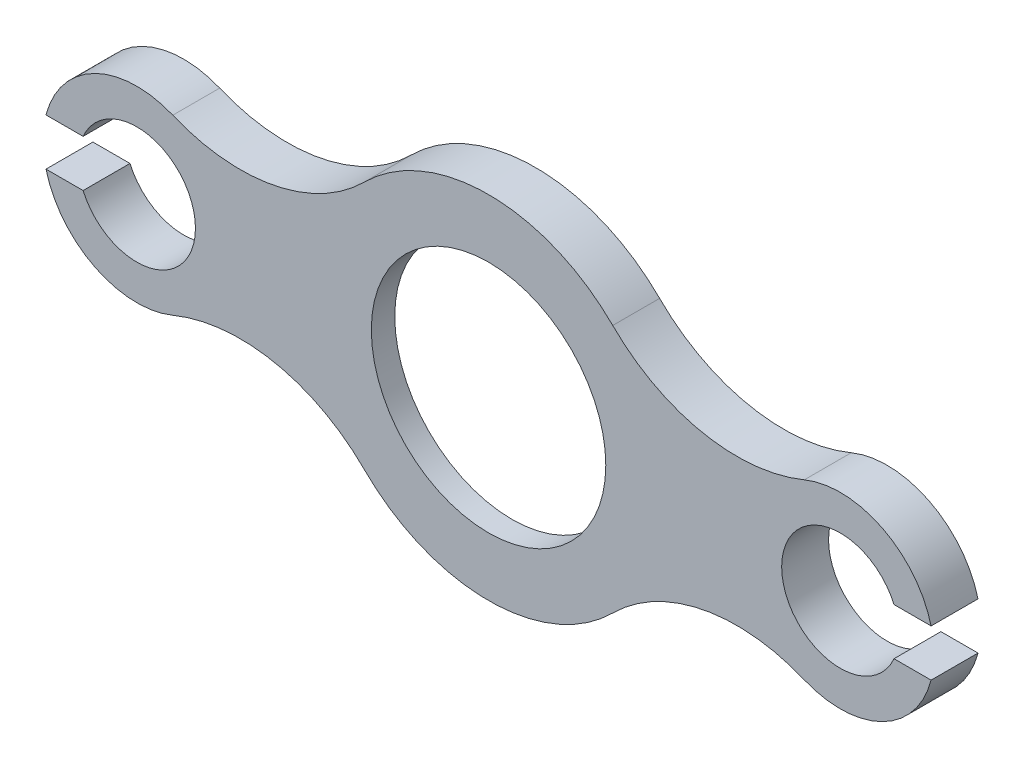
ISO-10303-21;
HEADER;
FILE_DESCRIPTION(('STEP AP214'),'2;1');
FILE_NAME('part.step','',(''),(''),'','','');
FILE_SCHEMA(('AUTOMOTIVE_DESIGN { 1 0 10303 214 1 1 1 1 }'));
ENDSEC;
DATA;
#1=APPLICATION_CONTEXT('core data for automotive mechanical design processes');
#2=APPLICATION_PROTOCOL_DEFINITION('international standard','automotive_design',2000,#1);
#3=PRODUCT_CONTEXT('',#1,'mechanical');
#4=PRODUCT('Part','Part','',(#3));
#5=PRODUCT_RELATED_PRODUCT_CATEGORY('part','',(#4));
#6=PRODUCT_DEFINITION_FORMATION('','',#4);
#7=PRODUCT_DEFINITION_CONTEXT('part definition',#1,'design');
#8=PRODUCT_DEFINITION('design','',#6,#7);
#9=PRODUCT_DEFINITION_SHAPE('','',#8);
#10=(LENGTH_UNIT() NAMED_UNIT(*) SI_UNIT(.MILLI.,.METRE.));
#11=(NAMED_UNIT(*) PLANE_ANGLE_UNIT() SI_UNIT($,.RADIAN.));
#12=(NAMED_UNIT(*) SI_UNIT($,.STERADIAN.) SOLID_ANGLE_UNIT());
#13=UNCERTAINTY_MEASURE_WITH_UNIT(LENGTH_MEASURE(1.E-05),#10,'distance_accuracy_value','');
#14=(GEOMETRIC_REPRESENTATION_CONTEXT(3) GLOBAL_UNCERTAINTY_ASSIGNED_CONTEXT((#13)) GLOBAL_UNIT_ASSIGNED_CONTEXT((#10,
#11,#12)) REPRESENTATION_CONTEXT('',''));
#15=CARTESIAN_POINT('',(0.,0.,0.));
#16=DIRECTION('',(0.,0.,1.));
#17=DIRECTION('',(1.,0.,0.));
#18=AXIS2_PLACEMENT_3D('',#15,#16,#17);
#19=CARTESIAN_POINT('',(150.,0.,20.));
#20=DIRECTION('',(0.,0.,-1.));
#21=DIRECTION('',(-1.,0.,0.));
#22=AXIS2_PLACEMENT_3D('',#19,#20,#21);
#23=CYLINDRICAL_SURFACE('',#22,40.);
#24=CARTESIAN_POINT('',(150.,0.,0.));
#25=DIRECTION('',(0.,0.,1.));
#26=DIRECTION('',(1.,0.,0.));
#27=AXIS2_PLACEMENT_3D('',#24,#25,#26);
#28=CIRCLE('',#27,40.);
#29=CARTESIAN_POINT('',(188.729833462074,-10.,0.));
#30=VERTEX_POINT('',#29);
#31=CARTESIAN_POINT('',(134.666666666667,-36.9444026733264,0.));
#32=VERTEX_POINT('',#31);
#33=EDGE_CURVE('E188',#30,#32,#28,.F.);
#34=ORIENTED_EDGE('',*,*,#33,.F.);
#35=DIRECTION('',(0.,0.,-1.));
#36=VECTOR('',#35,1.);
#37=CARTESIAN_POINT('',(188.729833462074,-10.,20.));
#38=LINE('',#37,#36);
#39=CARTESIAN_POINT('',(188.729833462074,-10.,20.));
#40=VERTEX_POINT('',#39);
#41=EDGE_CURVE('E11',#40,#30,#38,.T.);
#42=ORIENTED_EDGE('',*,*,#41,.F.);
#43=CARTESIAN_POINT('',(150.,0.,20.));
#44=DIRECTION('',(0.,0.,1.));
#45=DIRECTION('',(1.,0.,0.));
#46=AXIS2_PLACEMENT_3D('',#43,#44,#45);
#47=CIRCLE('',#46,40.);
#48=CARTESIAN_POINT('',(134.666666666667,-36.9444026733264,20.));
#49=VERTEX_POINT('',#48);
#50=EDGE_CURVE('E229',#40,#49,#47,.F.);
#51=ORIENTED_EDGE('',*,*,#50,.T.);
#52=DIRECTION('',(0.,0.,-1.));
#53=VECTOR('',#52,1.);
#54=CARTESIAN_POINT('',(134.666666666667,-36.9444026733264,20.));
#55=LINE('',#54,#53);
#56=EDGE_CURVE('E57',#49,#32,#55,.T.);
#57=ORIENTED_EDGE('',*,*,#56,.T.);
#58=EDGE_LOOP('',(#34,#42,#51,#57));
#59=FACE_BOUND('',#58,.T.);
#60=ADVANCED_FACE('F41',(#59),#23,.T.);
#61=CARTESIAN_POINT('',(0.,-9.99999999999998,20.));
#62=DIRECTION('',(0.,-1.,0.));
#63=DIRECTION('',(1.,0.,0.));
#64=AXIS2_PLACEMENT_3D('',#61,#62,#63);
#65=PLANE('',#64);
#66=DIRECTION('',(-1.,0.,0.));
#67=VECTOR('',#66,1.);
#68=CARTESIAN_POINT('',(0.,-9.99999999999998,0.));
#69=LINE('',#68,#67);
#70=CARTESIAN_POINT('',(172.912878474779,-10.,0.));
#71=VERTEX_POINT('',#70);
#72=EDGE_CURVE('E190',#30,#71,#69,.T.);
#73=ORIENTED_EDGE('',*,*,#72,.T.);
#74=DIRECTION('',(0.,0.,-1.));
#75=VECTOR('',#74,1.);
#76=CARTESIAN_POINT('',(172.912878474779,-10.,20.));
#77=LINE('',#76,#75);
#78=CARTESIAN_POINT('',(172.912878474779,-10.,20.));
#79=VERTEX_POINT('',#78);
#80=EDGE_CURVE('E49',#79,#71,#77,.T.);
#81=ORIENTED_EDGE('',*,*,#80,.F.);
#82=DIRECTION('',(-1.,0.,0.));
#83=VECTOR('',#82,1.);
#84=CARTESIAN_POINT('',(0.,-9.99999999999998,20.));
#85=LINE('',#84,#83);
#86=EDGE_CURVE('E280',#40,#79,#85,.T.);
#87=ORIENTED_EDGE('',*,*,#86,.F.);
#88=ORIENTED_EDGE('',*,*,#41,.T.);
#89=EDGE_LOOP('',(#73,#81,#87,#88));
#90=FACE_BOUND('',#89,.T.);
#91=ADVANCED_FACE('F321',(#90),#65,.F.);
#92=CARTESIAN_POINT('',(150.,0.,20.));
#93=DIRECTION('',(0.,0.,-1.));
#94=DIRECTION('',(-1.,0.,0.));
#95=AXIS2_PLACEMENT_3D('',#92,#93,#94);
#96=CYLINDRICAL_SURFACE('',#95,25.);
#97=CARTESIAN_POINT('',(150.,0.,0.));
#98=DIRECTION('',(0.,0.,1.));
#99=DIRECTION('',(1.,0.,0.));
#100=AXIS2_PLACEMENT_3D('',#97,#98,#99);
#101=CIRCLE('',#100,25.);
#102=CARTESIAN_POINT('',(172.912878474779,10.,0.));
#103=VERTEX_POINT('',#102);
#104=EDGE_CURVE('E193',#71,#103,#101,.F.);
#105=ORIENTED_EDGE('',*,*,#104,.T.);
#106=DIRECTION('',(0.,0.,-1.));
#107=VECTOR('',#106,1.);
#108=CARTESIAN_POINT('',(172.912878474779,10.,20.));
#109=LINE('',#108,#107);
#110=CARTESIAN_POINT('',(172.912878474779,10.,20.));
#111=VERTEX_POINT('',#110);
#112=EDGE_CURVE('E253',#111,#103,#109,.T.);
#113=ORIENTED_EDGE('',*,*,#112,.F.);
#114=CARTESIAN_POINT('',(150.,0.,20.));
#115=DIRECTION('',(0.,0.,1.));
#116=DIRECTION('',(1.,0.,0.));
#117=AXIS2_PLACEMENT_3D('',#114,#115,#116);
#118=CIRCLE('',#117,25.);
#119=EDGE_CURVE('E261',#79,#111,#118,.F.);
#120=ORIENTED_EDGE('',*,*,#119,.F.);
#121=ORIENTED_EDGE('',*,*,#80,.T.);
#122=EDGE_LOOP('',(#105,#113,#120,#121));
#123=FACE_BOUND('',#122,.T.);
#124=ADVANCED_FACE('F259',(#123),#96,.F.);
#125=CARTESIAN_POINT('',(0.,10.,20.));
#126=DIRECTION('',(0.,-1.,0.));
#127=DIRECTION('',(0.,0.,-1.));
#128=AXIS2_PLACEMENT_3D('',#125,#126,#127);
#129=PLANE('',#128);
#130=DIRECTION('',(-1.,0.,0.));
#131=VECTOR('',#130,1.);
#132=CARTESIAN_POINT('',(0.,10.,0.));
#133=LINE('',#132,#131);
#134=CARTESIAN_POINT('',(188.729833462074,10.,0.));
#135=VERTEX_POINT('',#134);
#136=EDGE_CURVE('E196',#135,#103,#133,.T.);
#137=ORIENTED_EDGE('',*,*,#136,.F.);
#138=DIRECTION('',(0.,0.,-1.));
#139=VECTOR('',#138,1.);
#140=CARTESIAN_POINT('',(188.729833462074,10.,20.));
#141=LINE('',#140,#139);
#142=CARTESIAN_POINT('',(188.729833462074,10.,20.));
#143=VERTEX_POINT('',#142);
#144=EDGE_CURVE('E251',#143,#135,#141,.T.);
#145=ORIENTED_EDGE('',*,*,#144,.F.);
#146=DIRECTION('',(-1.,0.,0.));
#147=VECTOR('',#146,1.);
#148=CARTESIAN_POINT('',(0.,10.,20.));
#149=LINE('',#148,#147);
#150=EDGE_CURVE('E273',#143,#111,#149,.T.);
#151=ORIENTED_EDGE('',*,*,#150,.T.);
#152=ORIENTED_EDGE('',*,*,#112,.T.);
#153=EDGE_LOOP('',(#137,#145,#151,#152));
#154=FACE_BOUND('',#153,.T.);
#155=ADVANCED_FACE('F270',(#154),#129,.T.);
#156=CARTESIAN_POINT('',(150.,0.,20.));
#157=DIRECTION('',(0.,0.,-1.));
#158=DIRECTION('',(-1.,0.,0.));
#159=AXIS2_PLACEMENT_3D('',#156,#157,#158);
#160=CYLINDRICAL_SURFACE('',#159,40.);
#161=CARTESIAN_POINT('',(150.,0.,0.));
#162=DIRECTION('',(0.,0.,1.));
#163=DIRECTION('',(1.,0.,0.));
#164=AXIS2_PLACEMENT_3D('',#161,#162,#163);
#165=CIRCLE('',#164,40.);
#166=CARTESIAN_POINT('',(134.666666666667,36.9444026733264,0.));
#167=VERTEX_POINT('',#166);
#168=EDGE_CURVE('E199',#167,#135,#165,.F.);
#169=ORIENTED_EDGE('',*,*,#168,.F.);
#170=DIRECTION('',(0.,0.,-1.));
#171=VECTOR('',#170,1.);
#172=CARTESIAN_POINT('',(134.666666666667,36.9444026733264,20.));
#173=LINE('',#172,#171);
#174=CARTESIAN_POINT('',(134.666666666667,36.9444026733264,20.));
#175=VERTEX_POINT('',#174);
#176=EDGE_CURVE('E249',#175,#167,#173,.T.);
#177=ORIENTED_EDGE('',*,*,#176,.F.);
#178=CARTESIAN_POINT('',(150.,0.,20.));
#179=DIRECTION('',(0.,0.,1.));
#180=DIRECTION('',(1.,0.,0.));
#181=AXIS2_PLACEMENT_3D('',#178,#179,#180);
#182=CIRCLE('',#181,40.);
#183=EDGE_CURVE('E276',#175,#143,#182,.F.);
#184=ORIENTED_EDGE('',*,*,#183,.T.);
#185=ORIENTED_EDGE('',*,*,#144,.T.);
#186=EDGE_LOOP('',(#169,#177,#184,#185));
#187=FACE_BOUND('',#186,.T.);
#188=ADVANCED_FACE('F505',(#187),#160,.T.);
#189=CARTESIAN_POINT('',(105.916666666667,106.215157685813,20.));
#190=DIRECTION('',(0.,0.,-1.));
#191=DIRECTION('',(-1.,0.,0.));
#192=AXIS2_PLACEMENT_3D('',#189,#190,#191);
#193=CYLINDRICAL_SURFACE('',#192,75.);
#194=CARTESIAN_POINT('',(105.916666666667,106.215157685813,0.));
#195=DIRECTION('',(0.,0.,1.));
#196=DIRECTION('',(1.,0.,0.));
#197=AXIS2_PLACEMENT_3D('',#194,#195,#196);
#198=CIRCLE('',#197,75.);
#199=CARTESIAN_POINT('',(52.9583333333334,53.1075788429067,0.));
#200=VERTEX_POINT('',#199);
#201=EDGE_CURVE('E202',#167,#200,#198,.F.);
#202=ORIENTED_EDGE('',*,*,#201,.T.);
#203=DIRECTION('',(0.,0.,-1.));
#204=VECTOR('',#203,1.);
#205=CARTESIAN_POINT('',(52.9583333333334,53.1075788429067,20.));
#206=LINE('',#205,#204);
#207=CARTESIAN_POINT('',(52.9583333333334,53.1075788429067,20.));
#208=VERTEX_POINT('',#207);
#209=EDGE_CURVE('E246',#208,#200,#206,.T.);
#210=ORIENTED_EDGE('',*,*,#209,.F.);
#211=CARTESIAN_POINT('',(105.916666666667,106.215157685813,20.));
#212=DIRECTION('',(0.,0.,1.));
#213=DIRECTION('',(1.,0.,0.));
#214=AXIS2_PLACEMENT_3D('',#211,#212,#213);
#215=CIRCLE('',#214,75.);
#216=EDGE_CURVE('E278',#175,#208,#215,.F.);
#217=ORIENTED_EDGE('',*,*,#216,.F.);
#218=ORIENTED_EDGE('',*,*,#176,.T.);
#219=EDGE_LOOP('',(#202,#210,#217,#218));
#220=FACE_BOUND('',#219,.T.);
#221=ADVANCED_FACE('F494',(#220),#193,.F.);
#222=CARTESIAN_POINT('',(0.,0.,20.));
#223=DIRECTION('',(0.,0.,-1.));
#224=DIRECTION('',(-1.,0.,0.));
#225=AXIS2_PLACEMENT_3D('',#222,#223,#224);
#226=CYLINDRICAL_SURFACE('',#225,75.);
#227=CARTESIAN_POINT('',(0.,0.,0.));
#228=DIRECTION('',(0.,0.,1.));
#229=DIRECTION('',(1.,0.,0.));
#230=AXIS2_PLACEMENT_3D('',#227,#228,#229);
#231=CIRCLE('',#230,75.);
#232=CARTESIAN_POINT('',(-52.9583333333334,53.1075788429067,0.));
#233=VERTEX_POINT('',#232);
#234=EDGE_CURVE('E204',#200,#233,#231,.T.);
#235=ORIENTED_EDGE('',*,*,#234,.T.);
#236=DIRECTION('',(0.,0.,-1.));
#237=VECTOR('',#236,1.);
#238=CARTESIAN_POINT('',(-52.9583333333334,53.1075788429067,20.));
#239=LINE('',#238,#237);
#240=CARTESIAN_POINT('',(-52.9583333333334,53.1075788429067,20.));
#241=VERTEX_POINT('',#240);
#242=EDGE_CURVE('E244',#241,#233,#239,.T.);
#243=ORIENTED_EDGE('',*,*,#242,.F.);
#244=CARTESIAN_POINT('',(0.,0.,20.));
#245=DIRECTION('',(0.,0.,1.));
#246=DIRECTION('',(1.,0.,0.));
#247=AXIS2_PLACEMENT_3D('',#244,#245,#246);
#248=CIRCLE('',#247,75.);
#249=EDGE_CURVE('E285',#208,#241,#248,.T.);
#250=ORIENTED_EDGE('',*,*,#249,.F.);
#251=ORIENTED_EDGE('',*,*,#209,.T.);
#252=EDGE_LOOP('',(#235,#243,#250,#251));
#253=FACE_BOUND('',#252,.T.);
#254=ADVANCED_FACE('F483',(#253),#226,.T.);
#255=CARTESIAN_POINT('',(-105.916666666667,106.215157685813,20.));
#256=DIRECTION('',(0.,0.,-1.));
#257=DIRECTION('',(-1.,0.,0.));
#258=AXIS2_PLACEMENT_3D('',#255,#256,#257);
#259=CYLINDRICAL_SURFACE('',#258,75.);
#260=CARTESIAN_POINT('',(-105.916666666667,106.215157685813,0.));
#261=DIRECTION('',(0.,0.,1.));
#262=DIRECTION('',(1.,0.,0.));
#263=AXIS2_PLACEMENT_3D('',#260,#261,#262);
#264=CIRCLE('',#263,75.);
#265=CARTESIAN_POINT('',(-134.666666666667,36.9444026733264,0.));
#266=VERTEX_POINT('',#265);
#267=EDGE_CURVE('E207',#266,#233,#264,.T.);
#268=ORIENTED_EDGE('',*,*,#267,.F.);
#269=DIRECTION('',(0.,0.,-1.));
#270=VECTOR('',#269,1.);
#271=CARTESIAN_POINT('',(-134.666666666667,36.9444026733264,20.));
#272=LINE('',#271,#270);
#273=CARTESIAN_POINT('',(-134.666666666667,36.9444026733264,20.));
#274=VERTEX_POINT('',#273);
#275=EDGE_CURVE('E242',#274,#266,#272,.T.);
#276=ORIENTED_EDGE('',*,*,#275,.F.);
#277=CARTESIAN_POINT('',(-105.916666666667,106.215157685813,20.));
#278=DIRECTION('',(0.,0.,1.));
#279=DIRECTION('',(1.,0.,0.));
#280=AXIS2_PLACEMENT_3D('',#277,#278,#279);
#281=CIRCLE('',#280,75.);
#282=EDGE_CURVE('E287',#274,#241,#281,.T.);
#283=ORIENTED_EDGE('',*,*,#282,.T.);
#284=ORIENTED_EDGE('',*,*,#242,.T.);
#285=EDGE_LOOP('',(#268,#276,#283,#284));
#286=FACE_BOUND('',#285,.T.);
#287=ADVANCED_FACE('F472',(#286),#259,.F.);
#288=CARTESIAN_POINT('',(-150.,0.,20.));
#289=DIRECTION('',(0.,0.,-1.));
#290=DIRECTION('',(-1.,0.,0.));
#291=AXIS2_PLACEMENT_3D('',#288,#289,#290);
#292=CYLINDRICAL_SURFACE('',#291,40.);
#293=CARTESIAN_POINT('',(-150.,0.,0.));
#294=DIRECTION('',(0.,0.,1.));
#295=DIRECTION('',(1.,0.,0.));
#296=AXIS2_PLACEMENT_3D('',#293,#294,#295);
#297=CIRCLE('',#296,40.);
#298=CARTESIAN_POINT('',(-188.729833462074,10.,0.));
#299=VERTEX_POINT('',#298);
#300=EDGE_CURVE('E210',#266,#299,#297,.T.);
#301=ORIENTED_EDGE('',*,*,#300,.T.);
#302=DIRECTION('',(0.,0.,-1.));
#303=VECTOR('',#302,1.);
#304=CARTESIAN_POINT('',(-188.729833462074,10.,20.));
#305=LINE('',#304,#303);
#306=CARTESIAN_POINT('',(-188.729833462074,10.,20.));
#307=VERTEX_POINT('',#306);
#308=EDGE_CURVE('E239',#307,#299,#305,.T.);
#309=ORIENTED_EDGE('',*,*,#308,.F.);
#310=CARTESIAN_POINT('',(-150.,0.,20.));
#311=DIRECTION('',(0.,0.,1.));
#312=DIRECTION('',(1.,0.,0.));
#313=AXIS2_PLACEMENT_3D('',#310,#311,#312);
#314=CIRCLE('',#313,40.);
#315=EDGE_CURVE('E290',#274,#307,#314,.T.);
#316=ORIENTED_EDGE('',*,*,#315,.F.);
#317=ORIENTED_EDGE('',*,*,#275,.T.);
#318=EDGE_LOOP('',(#301,#309,#316,#317));
#319=FACE_BOUND('',#318,.T.);
#320=ADVANCED_FACE('F461',(#319),#292,.T.);
#321=CARTESIAN_POINT('',(0.,10.,20.));
#322=DIRECTION('',(0.,1.,0.));
#323=DIRECTION('',(0.,0.,1.));
#324=AXIS2_PLACEMENT_3D('',#321,#322,#323);
#325=PLANE('',#324);
#326=DIRECTION('',(1.,0.,0.));
#327=VECTOR('',#326,1.);
#328=CARTESIAN_POINT('',(0.,10.,0.));
#329=LINE('',#328,#327);
#330=CARTESIAN_POINT('',(-172.912878474779,10.,0.));
#331=VERTEX_POINT('',#330);
#332=EDGE_CURVE('E212',#299,#331,#329,.T.);
#333=ORIENTED_EDGE('',*,*,#332,.T.);
#334=DIRECTION('',(0.,0.,-1.));
#335=VECTOR('',#334,1.);
#336=CARTESIAN_POINT('',(-172.912878474779,10.,20.));
#337=LINE('',#336,#335);
#338=CARTESIAN_POINT('',(-172.912878474779,10.,20.));
#339=VERTEX_POINT('',#338);
#340=EDGE_CURVE('E237',#339,#331,#337,.T.);
#341=ORIENTED_EDGE('',*,*,#340,.F.);
#342=DIRECTION('',(1.,0.,0.));
#343=VECTOR('',#342,1.);
#344=CARTESIAN_POINT('',(0.,10.,20.));
#345=LINE('',#344,#343);
#346=EDGE_CURVE('E292',#307,#339,#345,.T.);
#347=ORIENTED_EDGE('',*,*,#346,.F.);
#348=ORIENTED_EDGE('',*,*,#308,.T.);
#349=EDGE_LOOP('',(#333,#341,#347,#348));
#350=FACE_BOUND('',#349,.T.);
#351=ADVANCED_FACE('F451',(#350),#325,.F.);
#352=CARTESIAN_POINT('',(-150.,0.,20.));
#353=DIRECTION('',(0.,0.,-1.));
#354=DIRECTION('',(-1.,0.,0.));
#355=AXIS2_PLACEMENT_3D('',#352,#353,#354);
#356=CYLINDRICAL_SURFACE('',#355,25.);
#357=CARTESIAN_POINT('',(-150.,0.,0.));
#358=DIRECTION('',(0.,0.,1.));
#359=DIRECTION('',(1.,0.,0.));
#360=AXIS2_PLACEMENT_3D('',#357,#358,#359);
#361=CIRCLE('',#360,25.);
#362=CARTESIAN_POINT('',(-172.912878474779,-10.,0.));
#363=VERTEX_POINT('',#362);
#364=EDGE_CURVE('E215',#363,#331,#361,.T.);
#365=ORIENTED_EDGE('',*,*,#364,.F.);
#366=DIRECTION('',(0.,0.,-1.));
#367=VECTOR('',#366,1.);
#368=CARTESIAN_POINT('',(-172.912878474779,-10.,20.));
#369=LINE('',#368,#367);
#370=CARTESIAN_POINT('',(-172.912878474779,-10.,20.));
#371=VERTEX_POINT('',#370);
#372=EDGE_CURVE('E235',#371,#363,#369,.T.);
#373=ORIENTED_EDGE('',*,*,#372,.F.);
#374=CARTESIAN_POINT('',(-150.,0.,20.));
#375=DIRECTION('',(0.,0.,1.));
#376=DIRECTION('',(1.,0.,0.));
#377=AXIS2_PLACEMENT_3D('',#374,#375,#376);
#378=CIRCLE('',#377,25.);
#379=EDGE_CURVE('E294',#371,#339,#378,.T.);
#380=ORIENTED_EDGE('',*,*,#379,.T.);
#381=ORIENTED_EDGE('',*,*,#340,.T.);
#382=EDGE_LOOP('',(#365,#373,#380,#381));
#383=FACE_BOUND('',#382,.T.);
#384=ADVANCED_FACE('F307',(#383),#356,.F.);
#385=CARTESIAN_POINT('',(0.,-9.99999999999998,20.));
#386=DIRECTION('',(0.,1.,0.));
#387=DIRECTION('',(-1.,0.,0.));
#388=AXIS2_PLACEMENT_3D('',#385,#386,#387);
#389=PLANE('',#388);
#390=DIRECTION('',(1.,0.,0.));
#391=VECTOR('',#390,1.);
#392=CARTESIAN_POINT('',(0.,-9.99999999999998,0.));
#393=LINE('',#392,#391);
#394=CARTESIAN_POINT('',(-188.729833462074,-10.,0.));
#395=VERTEX_POINT('',#394);
#396=EDGE_CURVE('E218',#395,#363,#393,.T.);
#397=ORIENTED_EDGE('',*,*,#396,.F.);
#398=DIRECTION('',(0.,0.,-1.));
#399=VECTOR('',#398,1.);
#400=CARTESIAN_POINT('',(-188.729833462074,-10.,20.));
#401=LINE('',#400,#399);
#402=CARTESIAN_POINT('',(-188.729833462074,-10.,20.));
#403=VERTEX_POINT('',#402);
#404=EDGE_CURVE('E233',#403,#395,#401,.T.);
#405=ORIENTED_EDGE('',*,*,#404,.F.);
#406=DIRECTION('',(1.,0.,0.));
#407=VECTOR('',#406,1.);
#408=CARTESIAN_POINT('',(0.,-9.99999999999998,20.));
#409=LINE('',#408,#407);
#410=EDGE_CURVE('E297',#403,#371,#409,.T.);
#411=ORIENTED_EDGE('',*,*,#410,.T.);
#412=ORIENTED_EDGE('',*,*,#372,.T.);
#413=EDGE_LOOP('',(#397,#405,#411,#412));
#414=FACE_BOUND('',#413,.T.);
#415=ADVANCED_FACE('F301',(#414),#389,.T.);
#416=CARTESIAN_POINT('',(-150.,0.,20.));
#417=DIRECTION('',(0.,0.,-1.));
#418=DIRECTION('',(-1.,0.,0.));
#419=AXIS2_PLACEMENT_3D('',#416,#417,#418);
#420=CYLINDRICAL_SURFACE('',#419,40.);
#421=CARTESIAN_POINT('',(-150.,0.,0.));
#422=DIRECTION('',(0.,0.,1.));
#423=DIRECTION('',(1.,0.,0.));
#424=AXIS2_PLACEMENT_3D('',#421,#422,#423);
#425=CIRCLE('',#424,40.);
#426=CARTESIAN_POINT('',(-134.666666666667,-36.9444026733264,0.));
#427=VERTEX_POINT('',#426);
#428=EDGE_CURVE('E221',#395,#427,#425,.T.);
#429=ORIENTED_EDGE('',*,*,#428,.T.);
#430=DIRECTION('',(0.,0.,-1.));
#431=VECTOR('',#430,1.);
#432=CARTESIAN_POINT('',(-134.666666666667,-36.9444026733264,20.));
#433=LINE('',#432,#431);
#434=CARTESIAN_POINT('',(-134.666666666667,-36.9444026733264,20.));
#435=VERTEX_POINT('',#434);
#436=EDGE_CURVE('E177',#435,#427,#433,.T.);
#437=ORIENTED_EDGE('',*,*,#436,.F.);
#438=CARTESIAN_POINT('',(-150.,0.,20.));
#439=DIRECTION('',(0.,0.,1.));
#440=DIRECTION('',(1.,0.,0.));
#441=AXIS2_PLACEMENT_3D('',#438,#439,#440);
#442=CIRCLE('',#441,40.);
#443=EDGE_CURVE('E165',#403,#435,#442,.T.);
#444=ORIENTED_EDGE('',*,*,#443,.F.);
#445=ORIENTED_EDGE('',*,*,#404,.T.);
#446=EDGE_LOOP('',(#429,#437,#444,#445));
#447=FACE_BOUND('',#446,.T.);
#448=ADVANCED_FACE('F311',(#447),#420,.T.);
#449=CARTESIAN_POINT('',(-105.916666666667,-106.215157685813,20.));
#450=DIRECTION('',(0.,0.,-1.));
#451=DIRECTION('',(-1.,0.,0.));
#452=AXIS2_PLACEMENT_3D('',#449,#450,#451);
#453=CYLINDRICAL_SURFACE('',#452,75.);
#454=CARTESIAN_POINT('',(-105.916666666667,-106.215157685813,0.));
#455=DIRECTION('',(0.,0.,1.));
#456=DIRECTION('',(1.,0.,0.));
#457=AXIS2_PLACEMENT_3D('',#454,#455,#456);
#458=CIRCLE('',#457,75.);
#459=CARTESIAN_POINT('',(-52.9583333333333,-53.1075788429067,0.));
#460=VERTEX_POINT('',#459);
#461=EDGE_CURVE('E174',#427,#460,#458,.F.);
#462=ORIENTED_EDGE('',*,*,#461,.T.);
#463=DIRECTION('',(0.,0.,-1.));
#464=VECTOR('',#463,1.);
#465=CARTESIAN_POINT('',(-52.9583333333333,-53.1075788429067,20.));
#466=LINE('',#465,#464);
#467=CARTESIAN_POINT('',(-52.9583333333333,-53.1075788429067,20.));
#468=VERTEX_POINT('',#467);
#469=EDGE_CURVE('E171',#468,#460,#466,.T.);
#470=ORIENTED_EDGE('',*,*,#469,.F.);
#471=CARTESIAN_POINT('',(-105.916666666667,-106.215157685813,20.));
#472=DIRECTION('',(0.,0.,1.));
#473=DIRECTION('',(1.,0.,0.));
#474=AXIS2_PLACEMENT_3D('',#471,#472,#473);
#475=CIRCLE('',#474,75.);
#476=EDGE_CURVE('E155',#435,#468,#475,.F.);
#477=ORIENTED_EDGE('',*,*,#476,.F.);
#478=ORIENTED_EDGE('',*,*,#436,.T.);
#479=EDGE_LOOP('',(#462,#470,#477,#478));
#480=FACE_BOUND('',#479,.T.);
#481=ADVANCED_FACE('F172',(#480),#453,.F.);
#482=CARTESIAN_POINT('',(0.,0.,20.));
#483=DIRECTION('',(0.,0.,-1.));
#484=DIRECTION('',(-1.,0.,0.));
#485=AXIS2_PLACEMENT_3D('',#482,#483,#484);
#486=CYLINDRICAL_SURFACE('',#485,75.);
#487=CARTESIAN_POINT('',(0.,0.,0.));
#488=DIRECTION('',(0.,0.,1.));
#489=DIRECTION('',(1.,0.,0.));
#490=AXIS2_PLACEMENT_3D('',#487,#488,#489);
#491=CIRCLE('',#490,75.);
#492=CARTESIAN_POINT('',(52.9583333333333,-53.1075788429068,0.));
#493=VERTEX_POINT('',#492);
#494=EDGE_CURVE('E224',#460,#493,#491,.T.);
#495=ORIENTED_EDGE('',*,*,#494,.T.);
#496=DIRECTION('',(0.,0.,-1.));
#497=VECTOR('',#496,1.);
#498=CARTESIAN_POINT('',(52.9583333333333,-53.1075788429068,20.));
#499=LINE('',#498,#497);
#500=CARTESIAN_POINT('',(52.9583333333333,-53.1075788429068,20.));
#501=VERTEX_POINT('',#500);
#502=EDGE_CURVE('E107',#501,#493,#499,.T.);
#503=ORIENTED_EDGE('',*,*,#502,.F.);
#504=CARTESIAN_POINT('',(0.,0.,20.));
#505=DIRECTION('',(0.,0.,1.));
#506=DIRECTION('',(1.,0.,0.));
#507=AXIS2_PLACEMENT_3D('',#504,#505,#506);
#508=CIRCLE('',#507,75.);
#509=EDGE_CURVE('E162',#468,#501,#508,.T.);
#510=ORIENTED_EDGE('',*,*,#509,.F.);
#511=ORIENTED_EDGE('',*,*,#469,.T.);
#512=EDGE_LOOP('',(#495,#503,#510,#511));
#513=FACE_BOUND('',#512,.T.);
#514=ADVANCED_FACE('F179',(#513),#486,.T.);
#515=CARTESIAN_POINT('',(105.916666666667,-106.215157685813,20.));
#516=DIRECTION('',(0.,0.,-1.));
#517=DIRECTION('',(-1.,0.,0.));
#518=AXIS2_PLACEMENT_3D('',#515,#516,#517);
#519=CYLINDRICAL_SURFACE('',#518,75.);
#520=CARTESIAN_POINT('',(105.916666666667,-106.215157685813,0.));
#521=DIRECTION('',(0.,0.,1.));
#522=DIRECTION('',(1.,0.,0.));
#523=AXIS2_PLACEMENT_3D('',#520,#521,#522);
#524=CIRCLE('',#523,75.);
#525=EDGE_CURVE('E226',#32,#493,#524,.T.);
#526=ORIENTED_EDGE('',*,*,#525,.F.);
#527=ORIENTED_EDGE('',*,*,#56,.F.);
#528=CARTESIAN_POINT('',(105.916666666667,-106.215157685813,20.));
#529=DIRECTION('',(0.,0.,1.));
#530=DIRECTION('',(1.,0.,0.));
#531=AXIS2_PLACEMENT_3D('',#528,#529,#530);
#532=CIRCLE('',#531,75.);
#533=EDGE_CURVE('E180',#49,#501,#532,.T.);
#534=ORIENTED_EDGE('',*,*,#533,.T.);
#535=ORIENTED_EDGE('',*,*,#502,.T.);
#536=EDGE_LOOP('',(#526,#527,#534,#535));
#537=FACE_BOUND('',#536,.T.);
#538=ADVANCED_FACE('F325',(#537),#519,.F.);
#539=CARTESIAN_POINT('',(0.,0.,20.));
#540=DIRECTION('',(0.,0.,-1.));
#541=DIRECTION('',(-1.,0.,0.));
#542=AXIS2_PLACEMENT_3D('',#539,#540,#541);
#543=CYLINDRICAL_SURFACE('',#542,50.);
#544=CARTESIAN_POINT('',(0.,0.,10.));
#545=DIRECTION('',(0.,0.,1.));
#546=DIRECTION('',(1.,0.,0.));
#547=AXIS2_PLACEMENT_3D('',#544,#545,#546);
#548=CIRCLE('',#547,50.);
#549=CARTESIAN_POINT('',(50.,0.,10.));
#550=VERTEX_POINT('',#549);
#551=EDGE_CURVE('E354',#550,#550,#548,.T.);
#552=ORIENTED_EDGE('',*,*,#551,.F.);
#553=EDGE_LOOP('',(#552));
#554=FACE_BOUND('',#553,.T.);
#555=CARTESIAN_POINT('',(0.,0.,20.));
#556=DIRECTION('',(0.,0.,1.));
#557=DIRECTION('',(1.,0.,0.));
#558=AXIS2_PLACEMENT_3D('',#555,#556,#557);
#559=CIRCLE('',#558,50.);
#560=CARTESIAN_POINT('',(50.,0.,20.));
#561=VERTEX_POINT('',#560);
#562=EDGE_CURVE('E182',#561,#561,#559,.T.);
#563=ORIENTED_EDGE('',*,*,#562,.T.);
#564=EDGE_LOOP('',(#563));
#565=FACE_BOUND('',#564,.T.);
#566=ADVANCED_FACE('F327',(#554,#565),#543,.F.);
#567=CARTESIAN_POINT('',(0.,0.,20.));
#568=DIRECTION('',(0.,0.,1.));
#569=DIRECTION('',(1.,0.,0.));
#570=AXIS2_PLACEMENT_3D('',#567,#568,#569);
#571=PLANE('',#570);
#572=ORIENTED_EDGE('',*,*,#50,.F.);
#573=ORIENTED_EDGE('',*,*,#86,.T.);
#574=ORIENTED_EDGE('',*,*,#119,.T.);
#575=ORIENTED_EDGE('',*,*,#150,.F.);
#576=ORIENTED_EDGE('',*,*,#183,.F.);
#577=ORIENTED_EDGE('',*,*,#216,.T.);
#578=ORIENTED_EDGE('',*,*,#249,.T.);
#579=ORIENTED_EDGE('',*,*,#282,.F.);
#580=ORIENTED_EDGE('',*,*,#315,.T.);
#581=ORIENTED_EDGE('',*,*,#346,.T.);
#582=ORIENTED_EDGE('',*,*,#379,.F.);
#583=ORIENTED_EDGE('',*,*,#410,.F.);
#584=ORIENTED_EDGE('',*,*,#443,.T.);
#585=ORIENTED_EDGE('',*,*,#476,.T.);
#586=ORIENTED_EDGE('',*,*,#509,.T.);
#587=ORIENTED_EDGE('',*,*,#533,.F.);
#588=EDGE_LOOP('',(#572,#573,#574,#575,#576,#577,#578,#579,#580,#581,#582,#583,#584,#585,#586,#587));
#589=FACE_BOUND('',#588,.T.);
#590=ORIENTED_EDGE('',*,*,#562,.F.);
#591=EDGE_LOOP('',(#590));
#592=FACE_BOUND('',#591,.T.);
#593=ADVANCED_FACE('F158',(#589,#592),#571,.T.);
#594=CARTESIAN_POINT('',(0.,0.,0.));
#595=DIRECTION('',(0.,0.,1.));
#596=DIRECTION('',(1.,0.,0.));
#597=AXIS2_PLACEMENT_3D('',#594,#595,#596);
#598=PLANE('',#597);
#599=CARTESIAN_POINT('',(0.,0.,0.));
#600=DIRECTION('',(0.,0.,1.));
#601=DIRECTION('',(1.,0.,0.));
#602=AXIS2_PLACEMENT_3D('',#599,#600,#601);
#603=CIRCLE('',#602,67.8);
#604=CARTESIAN_POINT('',(67.8,0.,0.));
#605=VERTEX_POINT('',#604);
#606=EDGE_CURVE('E358',#605,#605,#603,.T.);
#607=ORIENTED_EDGE('',*,*,#606,.T.);
#608=EDGE_LOOP('',(#607));
#609=FACE_BOUND('',#608,.T.);
#610=ORIENTED_EDGE('',*,*,#33,.T.);
#611=ORIENTED_EDGE('',*,*,#525,.T.);
#612=ORIENTED_EDGE('',*,*,#494,.F.);
#613=ORIENTED_EDGE('',*,*,#461,.F.);
#614=ORIENTED_EDGE('',*,*,#428,.F.);
#615=ORIENTED_EDGE('',*,*,#396,.T.);
#616=ORIENTED_EDGE('',*,*,#364,.T.);
#617=ORIENTED_EDGE('',*,*,#332,.F.);
#618=ORIENTED_EDGE('',*,*,#300,.F.);
#619=ORIENTED_EDGE('',*,*,#267,.T.);
#620=ORIENTED_EDGE('',*,*,#234,.F.);
#621=ORIENTED_EDGE('',*,*,#201,.F.);
#622=ORIENTED_EDGE('',*,*,#168,.T.);
#623=ORIENTED_EDGE('',*,*,#136,.T.);
#624=ORIENTED_EDGE('',*,*,#104,.F.);
#625=ORIENTED_EDGE('',*,*,#72,.F.);
#626=EDGE_LOOP('',(#610,#611,#612,#613,#614,#615,#616,#617,#618,#619,#620,#621,#622,#623,#624,#625));
#627=FACE_BOUND('',#626,.T.);
#628=ADVANCED_FACE('F265',(#609,#627),#598,.F.);
#629=CARTESIAN_POINT('',(0.,0.,10.));
#630=DIRECTION('',(0.,0.,-1.));
#631=DIRECTION('',(-1.,0.,0.));
#632=AXIS2_PLACEMENT_3D('',#629,#630,#631);
#633=CYLINDRICAL_SURFACE('',#632,67.8);
#634=CARTESIAN_POINT('',(0.,0.,10.));
#635=DIRECTION('',(0.,0.,1.));
#636=DIRECTION('',(1.,0.,0.));
#637=AXIS2_PLACEMENT_3D('',#634,#635,#636);
#638=CIRCLE('',#637,67.8);
#639=CARTESIAN_POINT('',(67.8,0.,10.));
#640=VERTEX_POINT('',#639);
#641=EDGE_CURVE('E191',#640,#640,#638,.T.);
#642=ORIENTED_EDGE('',*,*,#641,.T.);
#643=EDGE_LOOP('',(#642));
#644=FACE_BOUND('',#643,.T.);
#645=ORIENTED_EDGE('',*,*,#606,.F.);
#646=EDGE_LOOP('',(#645));
#647=FACE_BOUND('',#646,.T.);
#648=ADVANCED_FACE('F339',(#644,#647),#633,.F.);
#649=CARTESIAN_POINT('',(0.,0.,10.));
#650=DIRECTION('',(0.,0.,1.));
#651=DIRECTION('',(1.,0.,0.));
#652=AXIS2_PLACEMENT_3D('',#649,#650,#651);
#653=PLANE('',#652);
#654=ORIENTED_EDGE('',*,*,#551,.T.);
#655=EDGE_LOOP('',(#654));
#656=FACE_BOUND('',#655,.T.);
#657=ORIENTED_EDGE('',*,*,#641,.F.);
#658=EDGE_LOOP('',(#657));
#659=FACE_BOUND('',#658,.T.);
#660=ADVANCED_FACE('F345',(#656,#659),#653,.F.);
#661=CLOSED_SHELL('',(#60,#91,#124,#155,#188,#221,#254,#287,#320,#351,#384,#415,#448,#481,#514,
#538,#566,#593,#628,#648,#660));
#662=MANIFOLD_SOLID_BREP('B2',#661);
#663=ADVANCED_BREP_SHAPE_REPRESENTATION('',(#18,#662),#14);
#664=SHAPE_DEFINITION_REPRESENTATION(#9,#663);
ENDSEC;
END-ISO-10303-21;
